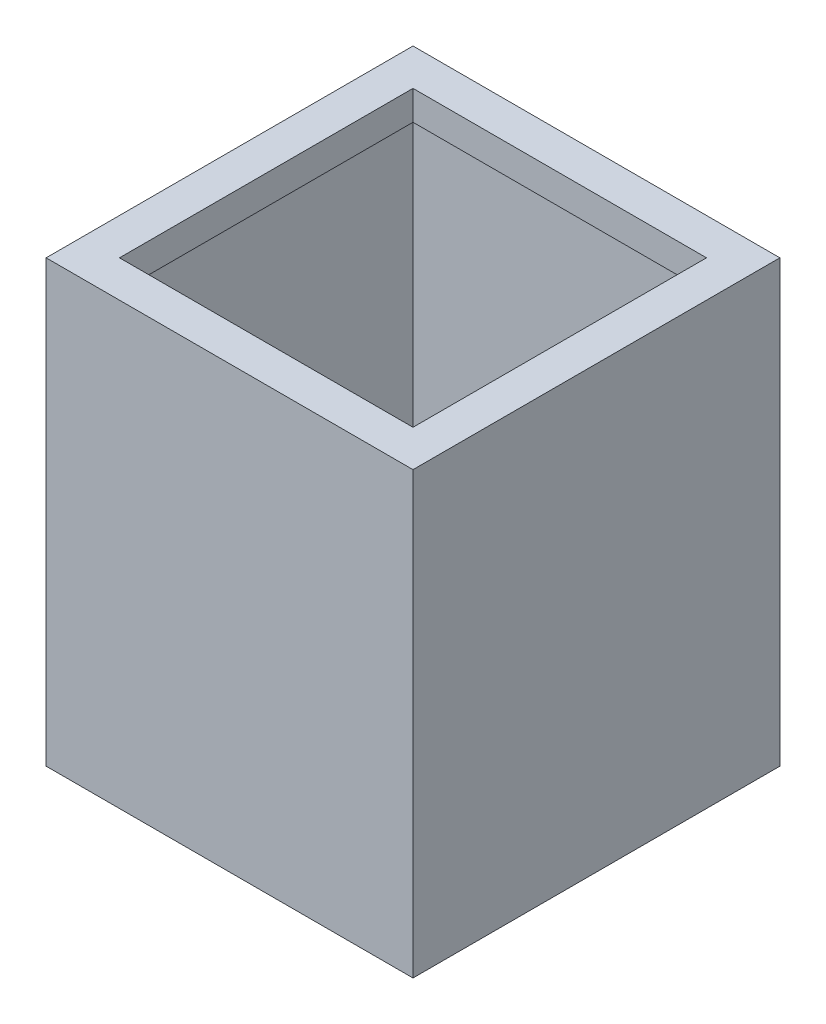
ISO-10303-21;
HEADER;
FILE_DESCRIPTION(('STEP AP214'),'2;1');
FILE_NAME('part.step','',(''),(''),'','','');
FILE_SCHEMA(('AUTOMOTIVE_DESIGN { 1 0 10303 214 1 1 1 1 }'));
ENDSEC;
DATA;
#1=APPLICATION_CONTEXT('core data for automotive mechanical design processes');
#2=APPLICATION_PROTOCOL_DEFINITION('international standard','automotive_design',2000,#1);
#3=PRODUCT_CONTEXT('',#1,'mechanical');
#4=PRODUCT('Part','Part','',(#3));
#5=PRODUCT_RELATED_PRODUCT_CATEGORY('part','',(#4));
#6=PRODUCT_DEFINITION_FORMATION('','',#4);
#7=PRODUCT_DEFINITION_CONTEXT('part definition',#1,'design');
#8=PRODUCT_DEFINITION('design','',#6,#7);
#9=PRODUCT_DEFINITION_SHAPE('','',#8);
#10=(LENGTH_UNIT() NAMED_UNIT(*) SI_UNIT(.MILLI.,.METRE.));
#11=(NAMED_UNIT(*) PLANE_ANGLE_UNIT() SI_UNIT($,.RADIAN.));
#12=(NAMED_UNIT(*) SI_UNIT($,.STERADIAN.) SOLID_ANGLE_UNIT());
#13=UNCERTAINTY_MEASURE_WITH_UNIT(LENGTH_MEASURE(1.E-05),#10,'distance_accuracy_value','');
#14=(GEOMETRIC_REPRESENTATION_CONTEXT(3) GLOBAL_UNCERTAINTY_ASSIGNED_CONTEXT((#13)) GLOBAL_UNIT_ASSIGNED_CONTEXT((#10,
#11,#12)) REPRESENTATION_CONTEXT('',''));
#15=CARTESIAN_POINT('',(0.,0.,0.));
#16=DIRECTION('',(0.,0.,1.));
#17=DIRECTION('',(1.,0.,0.));
#18=AXIS2_PLACEMENT_3D('',#15,#16,#17);
#19=CARTESIAN_POINT('',(-159.375,300.,-39.0625));
#20=DIRECTION('',(1.,0.,0.));
#21=DIRECTION('',(0.,0.,-1.));
#22=AXIS2_PLACEMENT_3D('',#19,#20,#21);
#23=PLANE('',#22);
#24=DIRECTION('',(0.,0.,1.));
#25=VECTOR('',#24,1.);
#26=CARTESIAN_POINT('',(-159.375,0.,-39.0625));
#27=LINE('',#26,#25);
#28=CARTESIAN_POINT('',(-159.375,0.,-39.0625));
#29=VERTEX_POINT('',#28);
#30=CARTESIAN_POINT('',(-159.375,0.,210.9375));
#31=VERTEX_POINT('',#30);
#32=EDGE_CURVE('E187',#29,#31,#27,.T.);
#33=ORIENTED_EDGE('',*,*,#32,.T.);
#34=DIRECTION('',(0.,-1.,0.));
#35=VECTOR('',#34,1.);
#36=CARTESIAN_POINT('',(-159.375,300.,210.9375));
#37=LINE('',#36,#35);
#38=CARTESIAN_POINT('',(-159.375,300.,210.9375));
#39=VERTEX_POINT('',#38);
#40=EDGE_CURVE('E11',#39,#31,#37,.T.);
#41=ORIENTED_EDGE('',*,*,#40,.F.);
#42=DIRECTION('',(0.,0.,1.));
#43=VECTOR('',#42,1.);
#44=CARTESIAN_POINT('',(-159.375,300.,-39.0625));
#45=LINE('',#44,#43);
#46=CARTESIAN_POINT('',(-159.375,300.,-39.0625));
#47=VERTEX_POINT('',#46);
#48=EDGE_CURVE('E193',#47,#39,#45,.T.);
#49=ORIENTED_EDGE('',*,*,#48,.F.);
#50=DIRECTION('',(0.,-1.,0.));
#51=VECTOR('',#50,1.);
#52=CARTESIAN_POINT('',(-159.375,300.,-39.0625));
#53=LINE('',#52,#51);
#54=EDGE_CURVE('E203',#47,#29,#53,.T.);
#55=ORIENTED_EDGE('',*,*,#54,.T.);
#56=EDGE_LOOP('',(#33,#41,#49,#55));
#57=FACE_BOUND('',#56,.T.);
#58=ADVANCED_FACE('F33',(#57),#23,.F.);
#59=CARTESIAN_POINT('',(-159.375,300.,210.9375));
#60=DIRECTION('',(0.,0.,-1.));
#61=DIRECTION('',(-1.,0.,0.));
#62=AXIS2_PLACEMENT_3D('',#59,#60,#61);
#63=PLANE('',#62);
#64=DIRECTION('',(1.,0.,0.));
#65=VECTOR('',#64,1.);
#66=CARTESIAN_POINT('',(-159.375,0.,210.9375));
#67=LINE('',#66,#65);
#68=CARTESIAN_POINT('',(90.625,0.,210.9375));
#69=VERTEX_POINT('',#68);
#70=EDGE_CURVE('E206',#31,#69,#67,.T.);
#71=ORIENTED_EDGE('',*,*,#70,.T.);
#72=DIRECTION('',(0.,-1.,0.));
#73=VECTOR('',#72,1.);
#74=CARTESIAN_POINT('',(90.625,300.,210.9375));
#75=LINE('',#74,#73);
#76=CARTESIAN_POINT('',(90.625,300.,210.9375));
#77=VERTEX_POINT('',#76);
#78=EDGE_CURVE('E40',#77,#69,#75,.T.);
#79=ORIENTED_EDGE('',*,*,#78,.F.);
#80=DIRECTION('',(1.,0.,0.));
#81=VECTOR('',#80,1.);
#82=CARTESIAN_POINT('',(-159.375,300.,210.9375));
#83=LINE('',#82,#81);
#84=EDGE_CURVE('E196',#39,#77,#83,.T.);
#85=ORIENTED_EDGE('',*,*,#84,.F.);
#86=ORIENTED_EDGE('',*,*,#40,.T.);
#87=EDGE_LOOP('',(#71,#79,#85,#86));
#88=FACE_BOUND('',#87,.T.);
#89=ADVANCED_FACE('F237',(#88),#63,.F.);
#90=CARTESIAN_POINT('',(90.6249999999999,300.,-39.0625));
#91=DIRECTION('',(-1.,0.,0.));
#92=DIRECTION('',(0.,0.,1.));
#93=AXIS2_PLACEMENT_3D('',#90,#91,#92);
#94=PLANE('',#93);
#95=DIRECTION('',(0.,0.,-1.));
#96=VECTOR('',#95,1.);
#97=CARTESIAN_POINT('',(90.6249999999999,0.,-39.0625));
#98=LINE('',#97,#96);
#99=CARTESIAN_POINT('',(90.6249999999999,0.,-39.0625));
#100=VERTEX_POINT('',#99);
#101=EDGE_CURVE('E208',#69,#100,#98,.T.);
#102=ORIENTED_EDGE('',*,*,#101,.T.);
#103=DIRECTION('',(0.,-1.,0.));
#104=VECTOR('',#103,1.);
#105=CARTESIAN_POINT('',(90.6249999999999,300.,-39.0625));
#106=LINE('',#105,#104);
#107=CARTESIAN_POINT('',(90.6249999999999,300.,-39.0625));
#108=VERTEX_POINT('',#107);
#109=EDGE_CURVE('E213',#108,#100,#106,.T.);
#110=ORIENTED_EDGE('',*,*,#109,.F.);
#111=DIRECTION('',(0.,0.,-1.));
#112=VECTOR('',#111,1.);
#113=CARTESIAN_POINT('',(90.6249999999999,300.,-39.0625));
#114=LINE('',#113,#112);
#115=EDGE_CURVE('E199',#77,#108,#114,.T.);
#116=ORIENTED_EDGE('',*,*,#115,.F.);
#117=ORIENTED_EDGE('',*,*,#78,.T.);
#118=EDGE_LOOP('',(#102,#110,#116,#117));
#119=FACE_BOUND('',#118,.T.);
#120=ADVANCED_FACE('F220',(#119),#94,.F.);
#121=CARTESIAN_POINT('',(-159.375,300.,-39.0625));
#122=DIRECTION('',(0.,0.,1.));
#123=DIRECTION('',(1.,0.,0.));
#124=AXIS2_PLACEMENT_3D('',#121,#122,#123);
#125=PLANE('',#124);
#126=DIRECTION('',(-1.,0.,0.));
#127=VECTOR('',#126,1.);
#128=CARTESIAN_POINT('',(-159.375,0.,-39.0625));
#129=LINE('',#128,#127);
#130=EDGE_CURVE('E197',#100,#29,#129,.T.);
#131=ORIENTED_EDGE('',*,*,#130,.T.);
#132=ORIENTED_EDGE('',*,*,#54,.F.);
#133=DIRECTION('',(-1.,0.,0.));
#134=VECTOR('',#133,1.);
#135=CARTESIAN_POINT('',(-159.375,300.,-39.0625));
#136=LINE('',#135,#134);
#137=EDGE_CURVE('E201',#108,#47,#136,.T.);
#138=ORIENTED_EDGE('',*,*,#137,.F.);
#139=ORIENTED_EDGE('',*,*,#109,.T.);
#140=EDGE_LOOP('',(#131,#132,#138,#139));
#141=FACE_BOUND('',#140,.T.);
#142=ADVANCED_FACE('F229',(#141),#125,.F.);
#143=CARTESIAN_POINT('',(0.,300.,0.));
#144=DIRECTION('',(0.,1.,0.));
#145=DIRECTION('',(0.,0.,1.));
#146=AXIS2_PLACEMENT_3D('',#143,#144,#145);
#147=PLANE('',#146);
#148=ORIENTED_EDGE('',*,*,#48,.T.);
#149=ORIENTED_EDGE('',*,*,#84,.T.);
#150=ORIENTED_EDGE('',*,*,#115,.T.);
#151=ORIENTED_EDGE('',*,*,#137,.T.);
#152=EDGE_LOOP('',(#148,#149,#150,#151));
#153=FACE_BOUND('',#152,.T.);
#154=DIRECTION('',(-1.,0.,0.));
#155=VECTOR('',#154,1.);
#156=CARTESIAN_POINT('',(-134.375,300.,-14.0625));
#157=LINE('',#156,#155);
#158=CARTESIAN_POINT('',(65.625,300.,-14.0625));
#159=VERTEX_POINT('',#158);
#160=CARTESIAN_POINT('',(-134.375,300.,-14.0625));
#161=VERTEX_POINT('',#160);
#162=EDGE_CURVE('E129',#159,#161,#157,.T.);
#163=ORIENTED_EDGE('',*,*,#162,.F.);
#164=DIRECTION('',(0.,0.,-1.));
#165=VECTOR('',#164,1.);
#166=CARTESIAN_POINT('',(65.625,300.,-14.0625));
#167=LINE('',#166,#165);
#168=CARTESIAN_POINT('',(65.625,300.,185.9375));
#169=VERTEX_POINT('',#168);
#170=EDGE_CURVE('E147',#169,#159,#167,.T.);
#171=ORIENTED_EDGE('',*,*,#170,.F.);
#172=DIRECTION('',(1.,0.,0.));
#173=VECTOR('',#172,1.);
#174=CARTESIAN_POINT('',(-134.375,300.,185.9375));
#175=LINE('',#174,#173);
#176=CARTESIAN_POINT('',(-134.375,300.,185.9375));
#177=VERTEX_POINT('',#176);
#178=EDGE_CURVE('E150',#177,#169,#175,.T.);
#179=ORIENTED_EDGE('',*,*,#178,.F.);
#180=DIRECTION('',(0.,0.,1.));
#181=VECTOR('',#180,1.);
#182=CARTESIAN_POINT('',(-134.375,300.,-14.0625));
#183=LINE('',#182,#181);
#184=EDGE_CURVE('E156',#161,#177,#183,.T.);
#185=ORIENTED_EDGE('',*,*,#184,.F.);
#186=EDGE_LOOP('',(#163,#171,#179,#185));
#187=FACE_BOUND('',#186,.T.);
#188=ADVANCED_FACE('F235',(#153,#187),#147,.T.);
#189=CARTESIAN_POINT('',(0.,0.,0.));
#190=DIRECTION('',(0.,1.,0.));
#191=DIRECTION('',(0.,0.,1.));
#192=AXIS2_PLACEMENT_3D('',#189,#190,#191);
#193=PLANE('',#192);
#194=ORIENTED_EDGE('',*,*,#32,.F.);
#195=ORIENTED_EDGE('',*,*,#130,.F.);
#196=ORIENTED_EDGE('',*,*,#101,.F.);
#197=ORIENTED_EDGE('',*,*,#70,.F.);
#198=EDGE_LOOP('',(#194,#195,#196,#197));
#199=FACE_BOUND('',#198,.T.);
#200=ADVANCED_FACE('F226',(#199),#193,.F.);
#201=CARTESIAN_POINT('',(0.,280.,0.));
#202=DIRECTION('',(0.,1.,0.));
#203=DIRECTION('',(0.,0.,1.));
#204=AXIS2_PLACEMENT_3D('',#201,#202,#203);
#205=PLANE('',#204);
#206=DIRECTION('',(0.,0.,-1.));
#207=VECTOR('',#206,1.);
#208=CARTESIAN_POINT('',(65.625,280.,-14.0625));
#209=LINE('',#208,#207);
#210=CARTESIAN_POINT('',(65.625,280.,185.9375));
#211=VERTEX_POINT('',#210);
#212=CARTESIAN_POINT('',(65.625,280.,-14.0625));
#213=VERTEX_POINT('',#212);
#214=EDGE_CURVE('E134',#211,#213,#209,.T.);
#215=ORIENTED_EDGE('',*,*,#214,.T.);
#216=DIRECTION('',(-1.,0.,0.));
#217=VECTOR('',#216,1.);
#218=CARTESIAN_POINT('',(-134.375,280.,-14.0625));
#219=LINE('',#218,#217);
#220=CARTESIAN_POINT('',(-134.375,280.,-14.0625));
#221=VERTEX_POINT('',#220);
#222=EDGE_CURVE('E126',#213,#221,#219,.T.);
#223=ORIENTED_EDGE('',*,*,#222,.T.);
#224=DIRECTION('',(0.,0.,1.));
#225=VECTOR('',#224,1.);
#226=CARTESIAN_POINT('',(-134.375,280.,-14.0625));
#227=LINE('',#226,#225);
#228=CARTESIAN_POINT('',(-134.375,280.,185.9375));
#229=VERTEX_POINT('',#228);
#230=EDGE_CURVE('E138',#221,#229,#227,.T.);
#231=ORIENTED_EDGE('',*,*,#230,.T.);
#232=DIRECTION('',(1.,0.,0.));
#233=VECTOR('',#232,1.);
#234=CARTESIAN_POINT('',(-134.375,280.,185.9375));
#235=LINE('',#234,#233);
#236=EDGE_CURVE('E142',#229,#211,#235,.T.);
#237=ORIENTED_EDGE('',*,*,#236,.T.);
#238=EDGE_LOOP('',(#215,#223,#231,#237));
#239=FACE_BOUND('',#238,.T.);
#240=DIRECTION('',(0.,0.,1.));
#241=VECTOR('',#240,1.);
#242=CARTESIAN_POINT('',(-154.375,280.,-34.0625));
#243=LINE('',#242,#241);
#244=CARTESIAN_POINT('',(-154.375,280.,-34.0625));
#245=VERTEX_POINT('',#244);
#246=CARTESIAN_POINT('',(-154.375,280.,205.9375));
#247=VERTEX_POINT('',#246);
#248=EDGE_CURVE('E162',#245,#247,#243,.T.);
#249=ORIENTED_EDGE('',*,*,#248,.F.);
#250=DIRECTION('',(-1.,0.,0.));
#251=VECTOR('',#250,1.);
#252=CARTESIAN_POINT('',(-154.375,280.,-34.0625));
#253=LINE('',#252,#251);
#254=CARTESIAN_POINT('',(85.625,280.,-34.0625));
#255=VERTEX_POINT('',#254);
#256=EDGE_CURVE('E47',#255,#245,#253,.T.);
#257=ORIENTED_EDGE('',*,*,#256,.F.);
#258=DIRECTION('',(0.,0.,-1.));
#259=VECTOR('',#258,1.);
#260=CARTESIAN_POINT('',(85.625,280.,-34.0625));
#261=LINE('',#260,#259);
#262=CARTESIAN_POINT('',(85.625,280.,205.9375));
#263=VERTEX_POINT('',#262);
#264=EDGE_CURVE('E55',#263,#255,#261,.T.);
#265=ORIENTED_EDGE('',*,*,#264,.F.);
#266=DIRECTION('',(1.,0.,0.));
#267=VECTOR('',#266,1.);
#268=CARTESIAN_POINT('',(-154.375,280.,205.9375));
#269=LINE('',#268,#267);
#270=EDGE_CURVE('E168',#247,#263,#269,.T.);
#271=ORIENTED_EDGE('',*,*,#270,.F.);
#272=EDGE_LOOP('',(#249,#257,#265,#271));
#273=FACE_BOUND('',#272,.T.);
#274=ADVANCED_FACE('F144',(#239,#273),#205,.F.);
#275=CARTESIAN_POINT('',(-134.375,280.,-14.0625));
#276=DIRECTION('',(0.,0.,-1.));
#277=DIRECTION('',(-1.,0.,0.));
#278=AXIS2_PLACEMENT_3D('',#275,#276,#277);
#279=PLANE('',#278);
#280=ORIENTED_EDGE('',*,*,#162,.T.);
#281=DIRECTION('',(0.,1.,0.));
#282=VECTOR('',#281,1.);
#283=CARTESIAN_POINT('',(-134.375,280.,-14.0625));
#284=LINE('',#283,#282);
#285=EDGE_CURVE('E122',#221,#161,#284,.T.);
#286=ORIENTED_EDGE('',*,*,#285,.F.);
#287=ORIENTED_EDGE('',*,*,#222,.F.);
#288=DIRECTION('',(0.,1.,0.));
#289=VECTOR('',#288,1.);
#290=CARTESIAN_POINT('',(65.625,280.,-14.0625));
#291=LINE('',#290,#289);
#292=EDGE_CURVE('E160',#213,#159,#291,.T.);
#293=ORIENTED_EDGE('',*,*,#292,.T.);
#294=EDGE_LOOP('',(#280,#286,#287,#293));
#295=FACE_BOUND('',#294,.T.);
#296=ADVANCED_FACE('F124',(#295),#279,.F.);
#297=CARTESIAN_POINT('',(65.625,280.,-14.0625));
#298=DIRECTION('',(1.,0.,0.));
#299=DIRECTION('',(0.,0.,-1.));
#300=AXIS2_PLACEMENT_3D('',#297,#298,#299);
#301=PLANE('',#300);
#302=ORIENTED_EDGE('',*,*,#170,.T.);
#303=ORIENTED_EDGE('',*,*,#292,.F.);
#304=ORIENTED_EDGE('',*,*,#214,.F.);
#305=DIRECTION('',(0.,1.,0.));
#306=VECTOR('',#305,1.);
#307=CARTESIAN_POINT('',(65.625,280.,185.9375));
#308=LINE('',#307,#306);
#309=EDGE_CURVE('E163',#211,#169,#308,.T.);
#310=ORIENTED_EDGE('',*,*,#309,.T.);
#311=EDGE_LOOP('',(#302,#303,#304,#310));
#312=FACE_BOUND('',#311,.T.);
#313=ADVANCED_FACE('F273',(#312),#301,.F.);
#314=CARTESIAN_POINT('',(-134.375,280.,185.9375));
#315=DIRECTION('',(0.,0.,1.));
#316=DIRECTION('',(1.,0.,0.));
#317=AXIS2_PLACEMENT_3D('',#314,#315,#316);
#318=PLANE('',#317);
#319=ORIENTED_EDGE('',*,*,#178,.T.);
#320=ORIENTED_EDGE('',*,*,#309,.F.);
#321=ORIENTED_EDGE('',*,*,#236,.F.);
#322=DIRECTION('',(0.,1.,0.));
#323=VECTOR('',#322,1.);
#324=CARTESIAN_POINT('',(-134.375,280.,185.9375));
#325=LINE('',#324,#323);
#326=EDGE_CURVE('E133',#229,#177,#325,.T.);
#327=ORIENTED_EDGE('',*,*,#326,.T.);
#328=EDGE_LOOP('',(#319,#320,#321,#327));
#329=FACE_BOUND('',#328,.T.);
#330=ADVANCED_FACE('F276',(#329),#318,.F.);
#331=CARTESIAN_POINT('',(-134.375,280.,-14.0625));
#332=DIRECTION('',(-1.,0.,0.));
#333=DIRECTION('',(0.,0.,1.));
#334=AXIS2_PLACEMENT_3D('',#331,#332,#333);
#335=PLANE('',#334);
#336=ORIENTED_EDGE('',*,*,#184,.T.);
#337=ORIENTED_EDGE('',*,*,#326,.F.);
#338=ORIENTED_EDGE('',*,*,#230,.F.);
#339=ORIENTED_EDGE('',*,*,#285,.T.);
#340=EDGE_LOOP('',(#336,#337,#338,#339));
#341=FACE_BOUND('',#340,.T.);
#342=ADVANCED_FACE('F139',(#341),#335,.F.);
#343=CARTESIAN_POINT('',(0.,5.,0.));
#344=DIRECTION('',(0.,1.,0.));
#345=DIRECTION('',(0.,0.,1.));
#346=AXIS2_PLACEMENT_3D('',#343,#344,#345);
#347=PLANE('',#346);
#348=DIRECTION('',(0.,0.,1.));
#349=VECTOR('',#348,1.);
#350=CARTESIAN_POINT('',(-154.375,5.,-34.0625));
#351=LINE('',#350,#349);
#352=CARTESIAN_POINT('',(-154.375,5.,-34.0625));
#353=VERTEX_POINT('',#352);
#354=CARTESIAN_POINT('',(-154.375,5.,205.9375));
#355=VERTEX_POINT('',#354);
#356=EDGE_CURVE('E172',#353,#355,#351,.T.);
#357=ORIENTED_EDGE('',*,*,#356,.T.);
#358=DIRECTION('',(1.,0.,0.));
#359=VECTOR('',#358,1.);
#360=CARTESIAN_POINT('',(-154.375,5.,205.9375));
#361=LINE('',#360,#359);
#362=CARTESIAN_POINT('',(85.625,5.,205.9375));
#363=VERTEX_POINT('',#362);
#364=EDGE_CURVE('E175',#355,#363,#361,.T.);
#365=ORIENTED_EDGE('',*,*,#364,.T.);
#366=DIRECTION('',(0.,0.,-1.));
#367=VECTOR('',#366,1.);
#368=CARTESIAN_POINT('',(85.625,5.,-34.0625));
#369=LINE('',#368,#367);
#370=CARTESIAN_POINT('',(85.625,5.,-34.0625));
#371=VERTEX_POINT('',#370);
#372=EDGE_CURVE('E178',#363,#371,#369,.T.);
#373=ORIENTED_EDGE('',*,*,#372,.T.);
#374=DIRECTION('',(-1.,0.,0.));
#375=VECTOR('',#374,1.);
#376=CARTESIAN_POINT('',(-154.375,5.,-34.0625));
#377=LINE('',#376,#375);
#378=EDGE_CURVE('E181',#371,#353,#377,.T.);
#379=ORIENTED_EDGE('',*,*,#378,.T.);
#380=EDGE_LOOP('',(#357,#365,#373,#379));
#381=FACE_BOUND('',#380,.T.);
#382=ADVANCED_FACE('F260',(#381),#347,.T.);
#383=CARTESIAN_POINT('',(-154.375,5.,205.9375));
#384=DIRECTION('',(0.,0.,1.));
#385=DIRECTION('',(1.,0.,0.));
#386=AXIS2_PLACEMENT_3D('',#383,#384,#385);
#387=PLANE('',#386);
#388=ORIENTED_EDGE('',*,*,#270,.T.);
#389=DIRECTION('',(0.,1.,0.));
#390=VECTOR('',#389,1.);
#391=CARTESIAN_POINT('',(85.625,5.,205.9375));
#392=LINE('',#391,#390);
#393=EDGE_CURVE('E190',#363,#263,#392,.T.);
#394=ORIENTED_EDGE('',*,*,#393,.F.);
#395=ORIENTED_EDGE('',*,*,#364,.F.);
#396=DIRECTION('',(0.,1.,0.));
#397=VECTOR('',#396,1.);
#398=CARTESIAN_POINT('',(-154.375,5.,205.9375));
#399=LINE('',#398,#397);
#400=EDGE_CURVE('E184',#355,#247,#399,.T.);
#401=ORIENTED_EDGE('',*,*,#400,.T.);
#402=EDGE_LOOP('',(#388,#394,#395,#401));
#403=FACE_BOUND('',#402,.T.);
#404=ADVANCED_FACE('F256',(#403),#387,.F.);
#405=CARTESIAN_POINT('',(85.625,5.,-34.0625));
#406=DIRECTION('',(1.,0.,0.));
#407=DIRECTION('',(0.,0.,-1.));
#408=AXIS2_PLACEMENT_3D('',#405,#406,#407);
#409=PLANE('',#408);
#410=ORIENTED_EDGE('',*,*,#264,.T.);
#411=DIRECTION('',(0.,1.,0.));
#412=VECTOR('',#411,1.);
#413=CARTESIAN_POINT('',(85.625,5.,-34.0625));
#414=LINE('',#413,#412);
#415=EDGE_CURVE('E188',#371,#255,#414,.T.);
#416=ORIENTED_EDGE('',*,*,#415,.F.);
#417=ORIENTED_EDGE('',*,*,#372,.F.);
#418=ORIENTED_EDGE('',*,*,#393,.T.);
#419=EDGE_LOOP('',(#410,#416,#417,#418));
#420=FACE_BOUND('',#419,.T.);
#421=ADVANCED_FACE('F259',(#420),#409,.F.);
#422=CARTESIAN_POINT('',(-154.375,5.,-34.0625));
#423=DIRECTION('',(0.,0.,-1.));
#424=DIRECTION('',(-1.,0.,0.));
#425=AXIS2_PLACEMENT_3D('',#422,#423,#424);
#426=PLANE('',#425);
#427=ORIENTED_EDGE('',*,*,#256,.T.);
#428=DIRECTION('',(0.,1.,0.));
#429=VECTOR('',#428,1.);
#430=CARTESIAN_POINT('',(-154.375,5.,-34.0625));
#431=LINE('',#430,#429);
#432=EDGE_CURVE('E185',#353,#245,#431,.T.);
#433=ORIENTED_EDGE('',*,*,#432,.F.);
#434=ORIENTED_EDGE('',*,*,#378,.F.);
#435=ORIENTED_EDGE('',*,*,#415,.T.);
#436=EDGE_LOOP('',(#427,#433,#434,#435));
#437=FACE_BOUND('',#436,.T.);
#438=ADVANCED_FACE('F254',(#437),#426,.F.);
#439=CARTESIAN_POINT('',(-154.375,5.,-34.0625));
#440=DIRECTION('',(-1.,0.,0.));
#441=DIRECTION('',(0.,0.,1.));
#442=AXIS2_PLACEMENT_3D('',#439,#440,#441);
#443=PLANE('',#442);
#444=ORIENTED_EDGE('',*,*,#248,.T.);
#445=ORIENTED_EDGE('',*,*,#400,.F.);
#446=ORIENTED_EDGE('',*,*,#356,.F.);
#447=ORIENTED_EDGE('',*,*,#432,.T.);
#448=EDGE_LOOP('',(#444,#445,#446,#447));
#449=FACE_BOUND('',#448,.T.);
#450=ADVANCED_FACE('F251',(#449),#443,.F.);
#451=CLOSED_SHELL('',(#58,#89,#120,#142,#188,#200,#274,#296,#313,#330,#342,#382,#404,#421,#438,#450));
#452=MANIFOLD_SOLID_BREP('B2',#451);
#453=ADVANCED_BREP_SHAPE_REPRESENTATION('',(#18,#452),#14);
#454=SHAPE_DEFINITION_REPRESENTATION(#9,#453);
ENDSEC;
END-ISO-10303-21;
